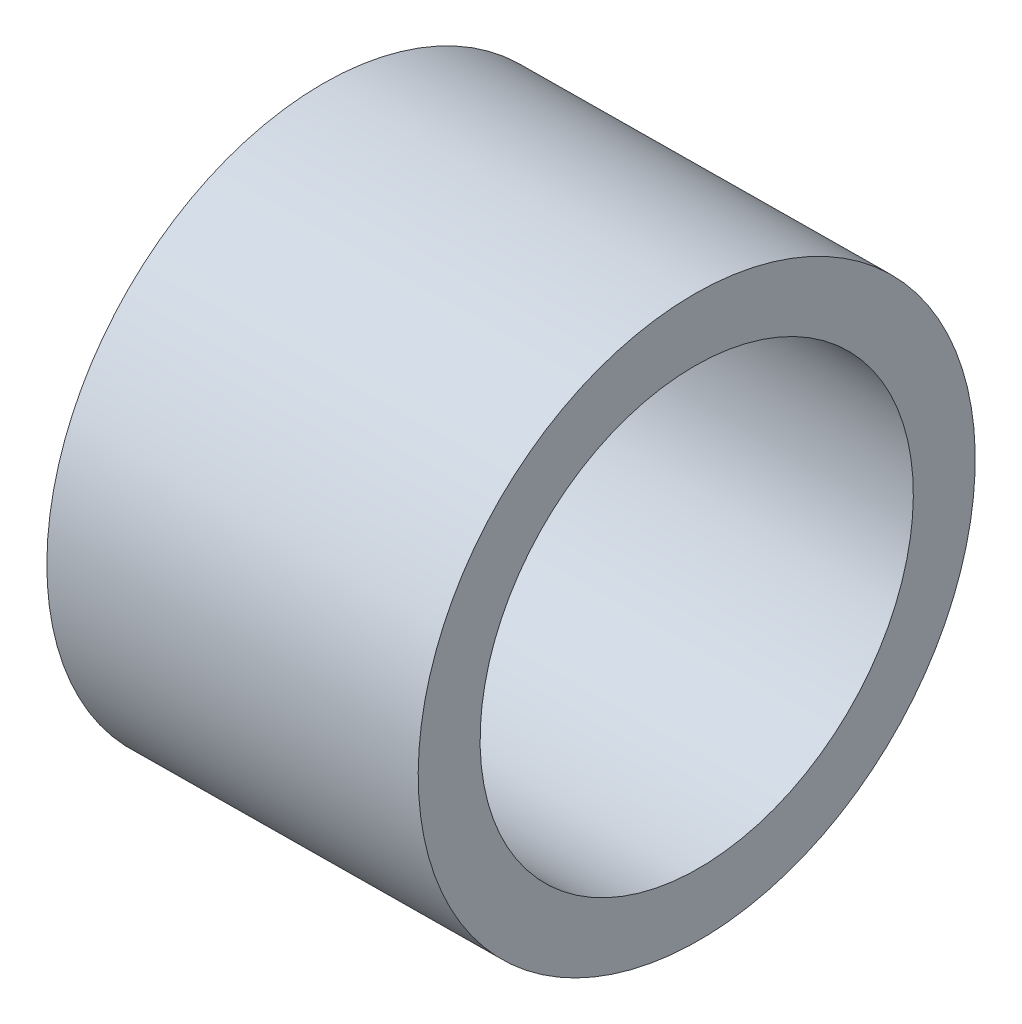
ISO-10303-21;
HEADER;
FILE_DESCRIPTION(('STEP AP214'),'2;1');
FILE_NAME('part.step','',(''),(''),'','','');
FILE_SCHEMA(('AUTOMOTIVE_DESIGN { 1 0 10303 214 1 1 1 1 }'));
ENDSEC;
DATA;
#1=APPLICATION_CONTEXT('core data for automotive mechanical design processes');
#2=APPLICATION_PROTOCOL_DEFINITION('international standard','automotive_design',2000,#1);
#3=PRODUCT_CONTEXT('',#1,'mechanical');
#4=PRODUCT('Part','Part','',(#3));
#5=PRODUCT_RELATED_PRODUCT_CATEGORY('part','',(#4));
#6=PRODUCT_DEFINITION_FORMATION('','',#4);
#7=PRODUCT_DEFINITION_CONTEXT('part definition',#1,'design');
#8=PRODUCT_DEFINITION('design','',#6,#7);
#9=PRODUCT_DEFINITION_SHAPE('','',#8);
#10=(LENGTH_UNIT() NAMED_UNIT(*) SI_UNIT(.MILLI.,.METRE.));
#11=(NAMED_UNIT(*) PLANE_ANGLE_UNIT() SI_UNIT($,.RADIAN.));
#12=(NAMED_UNIT(*) SI_UNIT($,.STERADIAN.) SOLID_ANGLE_UNIT());
#13=UNCERTAINTY_MEASURE_WITH_UNIT(LENGTH_MEASURE(1.E-05),#10,'distance_accuracy_value','');
#14=(GEOMETRIC_REPRESENTATION_CONTEXT(3) GLOBAL_UNCERTAINTY_ASSIGNED_CONTEXT((#13)) GLOBAL_UNIT_ASSIGNED_CONTEXT((#10,
#11,#12)) REPRESENTATION_CONTEXT('',''));
#15=CARTESIAN_POINT('',(0.,0.,0.));
#16=DIRECTION('',(0.,0.,1.));
#17=DIRECTION('',(1.,0.,0.));
#18=AXIS2_PLACEMENT_3D('',#15,#16,#17);
#19=CARTESIAN_POINT('',(13.0743361697834,0.0499030668038711,-6.38675888169536));
#20=DIRECTION('',(0.99995839142584,0.00912224846437149,0.));
#21=DIRECTION('',(0.,0.,-1.));
#22=AXIS2_PLACEMENT_3D('',#19,#20,#21);
#23=PLANE('',#22);
#24=CARTESIAN_POINT('',(13.0743361697834,0.0499030668038718,-6.38675888169536));
#25=DIRECTION('',(0.99995839142584,0.00912224846437139,0.));
#26=DIRECTION('',(-0.00912224846437139,0.99995839142584,0.));
#27=AXIS2_PLACEMENT_3D('',#24,#25,#26);
#28=CIRCLE('',#27,1.75);
#29=CARTESIAN_POINT('',(13.0583722349708,1.79983025179909,-6.38675888169536));
#30=VERTEX_POINT('',#29);
#31=EDGE_CURVE('E11',#30,#30,#28,.T.);
#32=ORIENTED_EDGE('',*,*,#31,.T.);
#33=EDGE_LOOP('',(#32));
#34=FACE_BOUND('',#33,.T.);
#35=CARTESIAN_POINT('',(13.0743361697834,0.0499030668038708,-6.38675888169536));
#36=DIRECTION('',(0.99995839142584,0.00912224846437128,0.));
#37=DIRECTION('',(-0.00912224846437128,0.99995839142584,0.));
#38=AXIS2_PLACEMENT_3D('',#35,#36,#37);
#39=CIRCLE('',#38,2.25);
#40=CARTESIAN_POINT('',(13.0538111107386,2.29980944751201,-6.38675888169536));
#41=VERTEX_POINT('',#40);
#42=EDGE_CURVE('E54',#41,#41,#39,.T.);
#43=ORIENTED_EDGE('',*,*,#42,.F.);
#44=EDGE_LOOP('',(#43));
#45=FACE_BOUND('',#44,.T.);
#46=ADVANCED_FACE('F17',(#34,#45),#23,.F.);
#47=CARTESIAN_POINT('',(16.0742113440609,0.0772698121969855,-6.38675888169536));
#48=DIRECTION('',(0.99995839142584,0.00912224846437149,0.));
#49=DIRECTION('',(0.,0.,-1.));
#50=AXIS2_PLACEMENT_3D('',#47,#48,#49);
#51=PLANE('',#50);
#52=CARTESIAN_POINT('',(16.0742113440609,0.077269812196986,-6.38675888169536));
#53=DIRECTION('',(0.99995839142584,0.00912224846437239,0.));
#54=DIRECTION('',(-0.00912224846437238,0.99995839142584,0.));
#55=AXIS2_PLACEMENT_3D('',#52,#53,#54);
#56=CIRCLE('',#55,1.75);
#57=CARTESIAN_POINT('',(16.0582474092483,1.82719699719221,-6.38675888169536));
#58=VERTEX_POINT('',#57);
#59=EDGE_CURVE('E20',#58,#58,#56,.T.);
#60=ORIENTED_EDGE('',*,*,#59,.F.);
#61=EDGE_LOOP('',(#60));
#62=FACE_BOUND('',#61,.T.);
#63=CARTESIAN_POINT('',(16.0742113440609,0.077269812196985,-6.38675888169536));
#64=DIRECTION('',(0.99995839142584,0.00912224846437128,0.));
#65=DIRECTION('',(-0.00912224846437128,0.99995839142584,0.));
#66=AXIS2_PLACEMENT_3D('',#63,#64,#65);
#67=CIRCLE('',#66,2.25);
#68=CARTESIAN_POINT('',(16.0536862850161,2.32717619290513,-6.38675888169536));
#69=VERTEX_POINT('',#68);
#70=EDGE_CURVE('E50',#69,#69,#67,.T.);
#71=ORIENTED_EDGE('',*,*,#70,.T.);
#72=EDGE_LOOP('',(#71));
#73=FACE_BOUND('',#72,.T.);
#74=ADVANCED_FACE('F51',(#62,#73),#51,.T.);
#75=CARTESIAN_POINT('',(16.0742113440609,0.077269812196986,-6.38675888169536));
#76=DIRECTION('',(-0.99995839142584,-0.00912224846437239,0.));
#77=DIRECTION('',(-0.00912224846437238,0.99995839142584,0.));
#78=AXIS2_PLACEMENT_3D('',#75,#76,#77);
#79=CYLINDRICAL_SURFACE('',#78,1.75);
#80=ORIENTED_EDGE('',*,*,#31,.F.);
#81=EDGE_LOOP('',(#80));
#82=FACE_BOUND('',#81,.T.);
#83=ORIENTED_EDGE('',*,*,#59,.T.);
#84=EDGE_LOOP('',(#83));
#85=FACE_BOUND('',#84,.T.);
#86=ADVANCED_FACE('F73',(#82,#85),#79,.F.);
#87=CARTESIAN_POINT('',(16.0742113440609,0.077269812196985,-6.38675888169536));
#88=DIRECTION('',(-0.99995839142584,-0.00912224846437129,0.));
#89=DIRECTION('',(-0.00912224846437129,0.99995839142584,0.));
#90=AXIS2_PLACEMENT_3D('',#87,#88,#89);
#91=CYLINDRICAL_SURFACE('',#90,2.25);
#92=ORIENTED_EDGE('',*,*,#42,.T.);
#93=EDGE_LOOP('',(#92));
#94=FACE_BOUND('',#93,.T.);
#95=ORIENTED_EDGE('',*,*,#70,.F.);
#96=EDGE_LOOP('',(#95));
#97=FACE_BOUND('',#96,.T.);
#98=ADVANCED_FACE('F68',(#94,#97),#91,.T.);
#99=CLOSED_SHELL('',(#46,#74,#86,#98));
#100=MANIFOLD_SOLID_BREP('B1',#99);
#101=ADVANCED_BREP_SHAPE_REPRESENTATION('',(#18,#100),#14);
#102=SHAPE_DEFINITION_REPRESENTATION(#9,#101);
ENDSEC;
END-ISO-10303-21;
